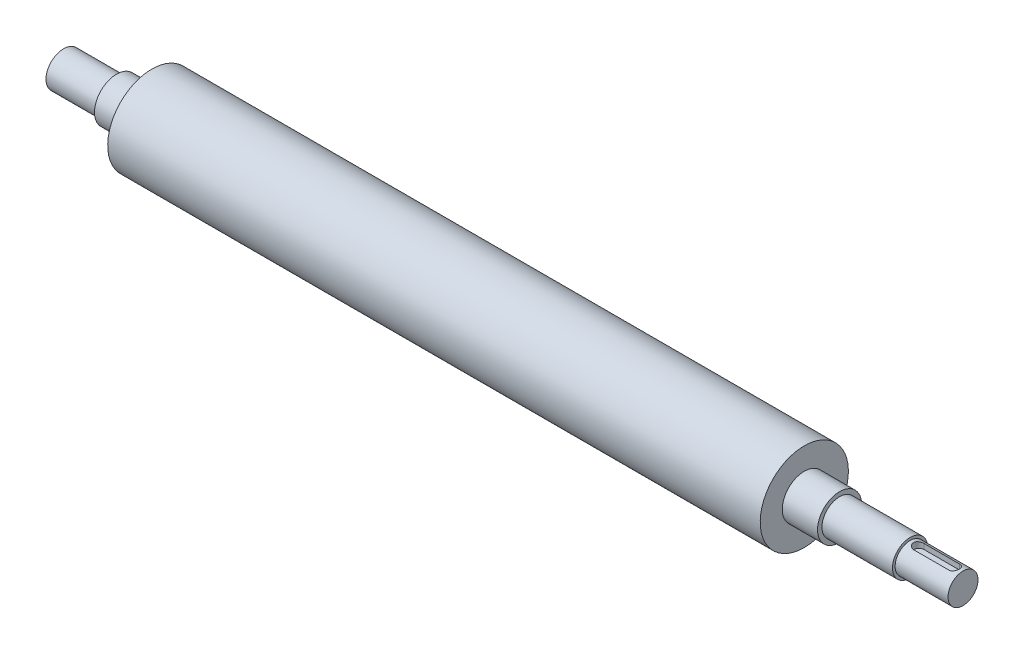
ISO-10303-21;
HEADER;
FILE_DESCRIPTION(('STEP AP214'),'2;1');
FILE_NAME('part.step','',(''),(''),'','','');
FILE_SCHEMA(('AUTOMOTIVE_DESIGN { 1 0 10303 214 1 1 1 1 }'));
ENDSEC;
DATA;
#1=APPLICATION_CONTEXT('core data for automotive mechanical design processes');
#2=APPLICATION_PROTOCOL_DEFINITION('international standard','automotive_design',2000,#1);
#3=PRODUCT_CONTEXT('',#1,'mechanical');
#4=PRODUCT('Part','Part','',(#3));
#5=PRODUCT_RELATED_PRODUCT_CATEGORY('part','',(#4));
#6=PRODUCT_DEFINITION_FORMATION('','',#4);
#7=PRODUCT_DEFINITION_CONTEXT('part definition',#1,'design');
#8=PRODUCT_DEFINITION('design','',#6,#7);
#9=PRODUCT_DEFINITION_SHAPE('','',#8);
#10=(LENGTH_UNIT() NAMED_UNIT(*) SI_UNIT(.MILLI.,.METRE.));
#11=(NAMED_UNIT(*) PLANE_ANGLE_UNIT() SI_UNIT($,.RADIAN.));
#12=(NAMED_UNIT(*) SI_UNIT($,.STERADIAN.) SOLID_ANGLE_UNIT());
#13=UNCERTAINTY_MEASURE_WITH_UNIT(LENGTH_MEASURE(1.E-05),#10,'distance_accuracy_value','');
#14=(GEOMETRIC_REPRESENTATION_CONTEXT(3) GLOBAL_UNCERTAINTY_ASSIGNED_CONTEXT((#13)) GLOBAL_UNIT_ASSIGNED_CONTEXT((#10,
#11,#12)) REPRESENTATION_CONTEXT('',''));
#15=CARTESIAN_POINT('',(0.,0.,0.));
#16=DIRECTION('',(0.,0.,1.));
#17=DIRECTION('',(1.,0.,0.));
#18=AXIS2_PLACEMENT_3D('',#15,#16,#17);
#19=CARTESIAN_POINT('',(245.,10.,0.));
#20=DIRECTION('',(-1.,0.,0.));
#21=DIRECTION('',(0.,-1.,0.));
#22=AXIS2_PLACEMENT_3D('',#19,#20,#21);
#23=PLANE('',#22);
#24=CARTESIAN_POINT('',(245.,0.,0.));
#25=DIRECTION('',(-1.,0.,0.));
#26=DIRECTION('',(0.,-1.,0.));
#27=AXIS2_PLACEMENT_3D('',#24,#25,#26);
#28=CIRCLE('',#27,9.99999999999999);
#29=CARTESIAN_POINT('',(245.,-9.99999999999993,0.));
#30=VERTEX_POINT('',#29);
#31=EDGE_CURVE('E160',#30,#30,#28,.T.);
#32=ORIENTED_EDGE('',*,*,#31,.F.);
#33=EDGE_LOOP('',(#32));
#34=FACE_BOUND('',#33,.T.);
#35=CARTESIAN_POINT('',(245.,0.,0.));
#36=DIRECTION('',(-1.,0.,0.));
#37=DIRECTION('',(0.,-1.,0.));
#38=AXIS2_PLACEMENT_3D('',#35,#36,#37);
#39=CIRCLE('',#38,8.49999999999994);
#40=CARTESIAN_POINT('',(245.,-8.49999999999988,0.));
#41=VERTEX_POINT('',#40);
#42=EDGE_CURVE('E111',#41,#41,#39,.T.);
#43=ORIENTED_EDGE('',*,*,#42,.T.);
#44=EDGE_LOOP('',(#43));
#45=FACE_BOUND('',#44,.T.);
#46=ADVANCED_FACE('F39',(#34,#45),#23,.F.);
#47=CARTESIAN_POINT('',(-235.,0.,0.));
#48=DIRECTION('',(-1.,0.,0.));
#49=DIRECTION('',(0.,-1.,0.));
#50=AXIS2_PLACEMENT_3D('',#47,#48,#49);
#51=CYLINDRICAL_SURFACE('',#50,9.99999999999999);
#52=CARTESIAN_POINT('',(205.,0.,0.));
#53=DIRECTION('',(-1.,0.,0.));
#54=DIRECTION('',(0.,-1.,0.));
#55=AXIS2_PLACEMENT_3D('',#52,#53,#54);
#56=CIRCLE('',#55,10.);
#57=CARTESIAN_POINT('',(205.,-9.99999999999994,0.));
#58=VERTEX_POINT('',#57);
#59=EDGE_CURVE('E156',#58,#58,#56,.T.);
#60=ORIENTED_EDGE('',*,*,#59,.F.);
#61=EDGE_LOOP('',(#60));
#62=FACE_BOUND('',#61,.T.);
#63=ORIENTED_EDGE('',*,*,#31,.T.);
#64=EDGE_LOOP('',(#63));
#65=FACE_BOUND('',#64,.T.);
#66=ADVANCED_FACE('F200',(#62,#65),#51,.T.);
#67=CARTESIAN_POINT('',(205.,10.,0.));
#68=DIRECTION('',(-1.,0.,0.));
#69=DIRECTION('',(0.,-1.,0.));
#70=AXIS2_PLACEMENT_3D('',#67,#68,#69);
#71=PLANE('',#70);
#72=CARTESIAN_POINT('',(205.,0.,0.));
#73=DIRECTION('',(-1.,0.,0.));
#74=DIRECTION('',(0.,-1.,0.));
#75=AXIS2_PLACEMENT_3D('',#72,#73,#74);
#76=CIRCLE('',#75,12.5);
#77=CARTESIAN_POINT('',(205.,-12.4999999999999,0.));
#78=VERTEX_POINT('',#77);
#79=EDGE_CURVE('E152',#78,#78,#76,.T.);
#80=ORIENTED_EDGE('',*,*,#79,.F.);
#81=EDGE_LOOP('',(#80));
#82=FACE_BOUND('',#81,.T.);
#83=ORIENTED_EDGE('',*,*,#59,.T.);
#84=EDGE_LOOP('',(#83));
#85=FACE_BOUND('',#84,.T.);
#86=ADVANCED_FACE('F205',(#82,#85),#71,.F.);
#87=CARTESIAN_POINT('',(-235.,0.,0.));
#88=DIRECTION('',(-1.,0.,0.));
#89=DIRECTION('',(0.,-1.,0.));
#90=AXIS2_PLACEMENT_3D('',#87,#88,#89);
#91=CYLINDRICAL_SURFACE('',#90,12.5);
#92=CARTESIAN_POINT('',(185.,0.,0.));
#93=DIRECTION('',(-1.,0.,0.));
#94=DIRECTION('',(0.,-1.,0.));
#95=AXIS2_PLACEMENT_3D('',#92,#93,#94);
#96=CIRCLE('',#95,12.5);
#97=CARTESIAN_POINT('',(185.,-12.4999999999999,0.));
#98=VERTEX_POINT('',#97);
#99=EDGE_CURVE('E148',#98,#98,#96,.T.);
#100=ORIENTED_EDGE('',*,*,#99,.F.);
#101=EDGE_LOOP('',(#100));
#102=FACE_BOUND('',#101,.T.);
#103=ORIENTED_EDGE('',*,*,#79,.T.);
#104=EDGE_LOOP('',(#103));
#105=FACE_BOUND('',#104,.T.);
#106=ADVANCED_FACE('F245',(#102,#105),#91,.T.);
#107=CARTESIAN_POINT('',(185.,25.,0.));
#108=DIRECTION('',(-1.,0.,0.));
#109=DIRECTION('',(0.,-1.,0.));
#110=AXIS2_PLACEMENT_3D('',#107,#108,#109);
#111=PLANE('',#110);
#112=CARTESIAN_POINT('',(185.,0.,0.));
#113=DIRECTION('',(-1.,0.,0.));
#114=DIRECTION('',(0.,-1.,0.));
#115=AXIS2_PLACEMENT_3D('',#112,#113,#114);
#116=CIRCLE('',#115,25.);
#117=CARTESIAN_POINT('',(185.,-24.9999999999999,0.));
#118=VERTEX_POINT('',#117);
#119=EDGE_CURVE('E144',#118,#118,#116,.T.);
#120=ORIENTED_EDGE('',*,*,#119,.F.);
#121=EDGE_LOOP('',(#120));
#122=FACE_BOUND('',#121,.T.);
#123=ORIENTED_EDGE('',*,*,#99,.T.);
#124=EDGE_LOOP('',(#123));
#125=FACE_BOUND('',#124,.T.);
#126=ADVANCED_FACE('F241',(#122,#125),#111,.F.);
#127=CARTESIAN_POINT('',(-235.,0.,0.));
#128=DIRECTION('',(-1.,0.,0.));
#129=DIRECTION('',(0.,-1.,0.));
#130=AXIS2_PLACEMENT_3D('',#127,#128,#129);
#131=CYLINDRICAL_SURFACE('',#130,25.);
#132=CARTESIAN_POINT('',(-185.,0.,0.));
#133=DIRECTION('',(-1.,0.,0.));
#134=DIRECTION('',(0.,-1.,0.));
#135=AXIS2_PLACEMENT_3D('',#132,#133,#134);
#136=CIRCLE('',#135,25.);
#137=CARTESIAN_POINT('',(-185.,-25.,0.));
#138=VERTEX_POINT('',#137);
#139=EDGE_CURVE('E140',#138,#138,#136,.T.);
#140=ORIENTED_EDGE('',*,*,#139,.F.);
#141=EDGE_LOOP('',(#140));
#142=FACE_BOUND('',#141,.T.);
#143=ORIENTED_EDGE('',*,*,#119,.T.);
#144=EDGE_LOOP('',(#143));
#145=FACE_BOUND('',#144,.T.);
#146=ADVANCED_FACE('F237',(#142,#145),#131,.T.);
#147=CARTESIAN_POINT('',(-185.,25.,0.));
#148=DIRECTION('',(1.,0.,0.));
#149=DIRECTION('',(0.,1.,0.));
#150=AXIS2_PLACEMENT_3D('',#147,#148,#149);
#151=PLANE('',#150);
#152=CARTESIAN_POINT('',(-185.,0.,0.));
#153=DIRECTION('',(-1.,0.,0.));
#154=DIRECTION('',(0.,-1.,0.));
#155=AXIS2_PLACEMENT_3D('',#152,#153,#154);
#156=CIRCLE('',#155,12.5);
#157=CARTESIAN_POINT('',(-185.,-12.5,0.));
#158=VERTEX_POINT('',#157);
#159=EDGE_CURVE('E136',#158,#158,#156,.T.);
#160=ORIENTED_EDGE('',*,*,#159,.F.);
#161=EDGE_LOOP('',(#160));
#162=FACE_BOUND('',#161,.T.);
#163=ORIENTED_EDGE('',*,*,#139,.T.);
#164=EDGE_LOOP('',(#163));
#165=FACE_BOUND('',#164,.T.);
#166=ADVANCED_FACE('F233',(#162,#165),#151,.F.);
#167=CARTESIAN_POINT('',(-235.,0.,0.));
#168=DIRECTION('',(-1.,0.,0.));
#169=DIRECTION('',(0.,-1.,0.));
#170=AXIS2_PLACEMENT_3D('',#167,#168,#169);
#171=CYLINDRICAL_SURFACE('',#170,12.5);
#172=CARTESIAN_POINT('',(-205.,0.,0.));
#173=DIRECTION('',(-1.,0.,0.));
#174=DIRECTION('',(0.,-1.,0.));
#175=AXIS2_PLACEMENT_3D('',#172,#173,#174);
#176=CIRCLE('',#175,12.5);
#177=CARTESIAN_POINT('',(-205.,-12.5,0.));
#178=VERTEX_POINT('',#177);
#179=EDGE_CURVE('E132',#178,#178,#176,.T.);
#180=ORIENTED_EDGE('',*,*,#179,.F.);
#181=EDGE_LOOP('',(#180));
#182=FACE_BOUND('',#181,.T.);
#183=ORIENTED_EDGE('',*,*,#159,.T.);
#184=EDGE_LOOP('',(#183));
#185=FACE_BOUND('',#184,.T.);
#186=ADVANCED_FACE('F229',(#182,#185),#171,.T.);
#187=CARTESIAN_POINT('',(-205.,10.,0.));
#188=DIRECTION('',(1.,0.,0.));
#189=DIRECTION('',(0.,1.,0.));
#190=AXIS2_PLACEMENT_3D('',#187,#188,#189);
#191=PLANE('',#190);
#192=CARTESIAN_POINT('',(-205.,0.,0.));
#193=DIRECTION('',(-1.,0.,0.));
#194=DIRECTION('',(0.,-1.,0.));
#195=AXIS2_PLACEMENT_3D('',#192,#193,#194);
#196=CIRCLE('',#195,10.);
#197=CARTESIAN_POINT('',(-205.,-9.99999999999999,0.));
#198=VERTEX_POINT('',#197);
#199=EDGE_CURVE('E128',#198,#198,#196,.T.);
#200=ORIENTED_EDGE('',*,*,#199,.F.);
#201=EDGE_LOOP('',(#200));
#202=FACE_BOUND('',#201,.T.);
#203=ORIENTED_EDGE('',*,*,#179,.T.);
#204=EDGE_LOOP('',(#203));
#205=FACE_BOUND('',#204,.T.);
#206=ADVANCED_FACE('F225',(#202,#205),#191,.F.);
#207=CARTESIAN_POINT('',(-235.,0.,0.));
#208=DIRECTION('',(-1.,0.,0.));
#209=DIRECTION('',(0.,-1.,0.));
#210=AXIS2_PLACEMENT_3D('',#207,#208,#209);
#211=CYLINDRICAL_SURFACE('',#210,10.);
#212=CARTESIAN_POINT('',(-235.,0.,0.));
#213=DIRECTION('',(-1.,0.,0.));
#214=DIRECTION('',(0.,-1.,0.));
#215=AXIS2_PLACEMENT_3D('',#212,#213,#214);
#216=CIRCLE('',#215,10.);
#217=CARTESIAN_POINT('',(-235.,-10.,0.));
#218=VERTEX_POINT('',#217);
#219=EDGE_CURVE('E124',#218,#218,#216,.T.);
#220=ORIENTED_EDGE('',*,*,#219,.F.);
#221=EDGE_LOOP('',(#220));
#222=FACE_BOUND('',#221,.T.);
#223=ORIENTED_EDGE('',*,*,#199,.T.);
#224=EDGE_LOOP('',(#223));
#225=FACE_BOUND('',#224,.T.);
#226=ADVANCED_FACE('F219',(#222,#225),#211,.T.);
#227=CARTESIAN_POINT('',(-235.,10.,0.));
#228=DIRECTION('',(1.,0.,0.));
#229=DIRECTION('',(0.,1.,0.));
#230=AXIS2_PLACEMENT_3D('',#227,#228,#229);
#231=PLANE('',#230);
#232=ORIENTED_EDGE('',*,*,#219,.T.);
#233=EDGE_LOOP('',(#232));
#234=FACE_BOUND('',#233,.T.);
#235=ADVANCED_FACE('F215',(#234),#231,.F.);
#236=CARTESIAN_POINT('',(275.,8.5,0.));
#237=DIRECTION('',(-1.,0.,0.));
#238=DIRECTION('',(0.,-1.,0.));
#239=AXIS2_PLACEMENT_3D('',#236,#237,#238);
#240=PLANE('',#239);
#241=CARTESIAN_POINT('',(275.,0.,0.));
#242=DIRECTION('',(-1.,0.,0.));
#243=DIRECTION('',(0.,-1.,0.));
#244=AXIS2_PLACEMENT_3D('',#241,#242,#243);
#245=CIRCLE('',#244,8.49999999999994);
#246=CARTESIAN_POINT('',(275.,-8.49999999999988,0.));
#247=VERTEX_POINT('',#246);
#248=EDGE_CURVE('E120',#247,#247,#245,.T.);
#249=ORIENTED_EDGE('',*,*,#248,.F.);
#250=EDGE_LOOP('',(#249));
#251=FACE_BOUND('',#250,.T.);
#252=ADVANCED_FACE('F197',(#251),#240,.F.);
#253=CARTESIAN_POINT('',(-235.,0.,0.));
#254=DIRECTION('',(-1.,0.,0.));
#255=DIRECTION('',(0.,-1.,0.));
#256=AXIS2_PLACEMENT_3D('',#253,#254,#255);
#257=CYLINDRICAL_SURFACE('',#256,8.49999999999994);
#258=DIRECTION('',(-1.,0.,0.));
#259=VECTOR('',#258,1.);
#260=CARTESIAN_POINT('',(-235.,7.95298686029337,-3.));
#261=LINE('',#260,#259);
#262=CARTESIAN_POINT('',(250.,7.95298686029343,-3.));
#263=VERTEX_POINT('',#262);
#264=CARTESIAN_POINT('',(270.,7.95298686029343,-3.));
#265=VERTEX_POINT('',#264);
#266=EDGE_CURVE('E11',#263,#265,#261,.F.);
#267=ORIENTED_EDGE('',*,*,#266,.T.);
#268=CARTESIAN_POINT('',(270.,7.95298686029343,-3.));
#269=CARTESIAN_POINT('',(270.081536451005,7.95297282317496,-3.00001111456469));
#270=CARTESIAN_POINT('',(270.16306513686,7.95424043309808,-2.99667616281438));
#271=CARTESIAN_POINT('',(270.32548339821,7.95923435007447,-2.98340078818416));
#272=CARTESIAN_POINT('',(270.406373157799,7.96295992065867,-2.97346234387641));
#273=CARTESIAN_POINT('',(270.56668088422,7.97274948260351,-2.94710907165024));
#274=CARTESIAN_POINT('',(270.646102753267,7.97880590130024,-2.93071521269501));
#275=CARTESIAN_POINT('',(270.803163764054,7.99305602658037,-2.89162336922697));
#276=CARTESIAN_POINT('',(270.88080282945,8.00124982450609,-2.86892511528895));
#277=CARTESIAN_POINT('',(271.110142384458,8.02866628944345,-2.79169040620691));
#278=CARTESIAN_POINT('',(271.258524672721,8.05074111407848,-2.72797079291555));
#279=CARTESIAN_POINT('',(271.542527359639,8.09998309095397,-2.57807364735464));
#280=CARTESIAN_POINT('',(271.678138633491,8.12715384335239,-2.49188022094082));
#281=CARTESIAN_POINT('',(271.938713920334,8.18485393887847,-2.29543806114915));
#282=CARTESIAN_POINT('',(272.063041901653,8.21547377204857,-2.1843705023649));
#283=CARTESIAN_POINT('',(272.291744233027,8.27586220443751,-1.94307879798324));
#284=CARTESIAN_POINT('',(272.396114896453,8.30563064552034,-1.81285112086691));
#285=CARTESIAN_POINT('',(272.584937067793,8.36202878085584,-1.53216678509012));
#286=CARTESIAN_POINT('',(272.668705670584,8.38853913830339,-1.38122456099169));
#287=CARTESIAN_POINT('',(272.809399535875,8.43435112113579,-1.06629732099155));
#288=CARTESIAN_POINT('',(272.866333820396,8.45365516891426,-0.902316710454007));
#289=CARTESIAN_POINT('',(272.949541995578,8.48223599195917,-0.572686128989449));
#290=CARTESIAN_POINT('',(272.976915424825,8.49187134280002,-0.407345398684575));
#291=CARTESIAN_POINT('',(273.003733376199,8.50130846817215,-0.0741521905856608));
#292=CARTESIAN_POINT('',(273.003185431652,8.50111289513587,0.093699597494171));
#293=CARTESIAN_POINT('',(272.974846478054,8.49114603495175,0.41931771456752));
#294=CARTESIAN_POINT('',(272.948252655351,8.4817955547378,0.577203282323874));
#295=CARTESIAN_POINT('',(272.870572820571,8.4551088236348,0.8861046421019));
#296=CARTESIAN_POINT('',(272.819485427458,8.43777212245602,1.03712004623328));
#297=CARTESIAN_POINT('',(272.693635628535,8.39655303420164,1.33047393825551));
#298=CARTESIAN_POINT('',(272.618554253207,8.3725830778079,1.47266277963517));
#299=CARTESIAN_POINT('',(272.447121442264,8.32056133127557,1.74275783980201));
#300=CARTESIAN_POINT('',(272.350763660659,8.29250832416193,1.87065978014285));
#301=CARTESIAN_POINT('',(272.133598733569,8.2335160105887,2.11563702552314));
#302=CARTESIAN_POINT('',(272.011776607443,8.2025024832695,2.23179650903278));
#303=CARTESIAN_POINT('',(271.750160727051,8.14228789618759,2.44236946081564));
#304=CARTESIAN_POINT('',(271.610360688581,8.11308747551658,2.53677529269979));
#305=CARTESIAN_POINT('',(271.313330116575,8.05935715695286,2.70269404193957));
#306=CARTESIAN_POINT('',(271.155828875121,8.03492183287739,2.77375950589015));
#307=CARTESIAN_POINT('',(270.911749632011,8.00466863989459,2.85940108363551));
#308=CARTESIAN_POINT('',(270.829101690326,7.99565197491509,2.88445274898887));
#309=CARTESIAN_POINT('',(270.661749484643,7.98003696838128,2.92737680685404));
#310=CARTESIAN_POINT('',(270.577046172907,7.97343752889355,2.94525245915398));
#311=CARTESIAN_POINT('',(270.410501437027,7.96316283519177,2.97292025835955));
#312=CARTESIAN_POINT('',(270.328726985238,7.95935855696889,2.9830699821345));
#313=CARTESIAN_POINT('',(270.164637991123,7.95426482451694,2.99661152862991));
#314=CARTESIAN_POINT('',(270.082324173949,7.95297249738802,3.00001107157817));
#315=CARTESIAN_POINT('',(270.,7.95298686029343,3.));
#316=B_SPLINE_CURVE_WITH_KNOTS('',3,(#268,#269,#270,#271,#272,#273,#274,#275,#276,#277,#278,
#279,#280,#281,#282,#283,#284,#285,#286,#287,#288,#289,#290,#291,#292,#293,#294,#295,#296,#297,
#298,#299,#300,#301,#302,#303,#304,#305,#306,#307,#308,#309,#310,#311,#312,#313,#314,#315),
.UNSPECIFIED.,.F.,.F.,(4,2,2,2,2,2,2,2,2,2,2,2,2,2,2,2,2,2,2,2,2,2,2,4),(0.,0.244518263038698,
0.48896329528471,0.73262076744457,0.976288654175243,1.46284365984006,1.94974370936357,
2.45596459157656,2.96227889562561,3.48361603671224,4.00477777271076,4.50580525888537,
5.00669756606285,5.48559776782672,5.96452497488343,6.45010405019667,6.93582815245477,
7.44695039963332,7.95825179844938,8.47884978164188,8.7390503763821,8.99913263783281,
9.24628958943068,9.4931637027445),.UNSPECIFIED.);
#317=CARTESIAN_POINT('',(270.,7.95298686029343,3.));
#318=VERTEX_POINT('',#317);
#319=EDGE_CURVE('E164',#265,#318,#316,.T.);
#320=ORIENTED_EDGE('',*,*,#319,.T.);
#321=DIRECTION('',(-1.,0.,0.));
#322=VECTOR('',#321,1.);
#323=CARTESIAN_POINT('',(-235.,7.95298686029337,3.));
#324=LINE('',#323,#322);
#325=CARTESIAN_POINT('',(250.,7.95298686029343,3.));
#326=VERTEX_POINT('',#325);
#327=EDGE_CURVE('E47',#318,#326,#324,.T.);
#328=ORIENTED_EDGE('',*,*,#327,.T.);
#329=CARTESIAN_POINT('',(250.,7.95298686029343,3.));
#330=CARTESIAN_POINT('',(249.918463548995,7.95297282317496,3.0000111145647));
#331=CARTESIAN_POINT('',(249.83693486314,7.95424043309807,2.99667616281439));
#332=CARTESIAN_POINT('',(249.67451660179,7.95923435007447,2.98340078818416));
#333=CARTESIAN_POINT('',(249.593626842201,7.96295992065867,2.97346234387641));
#334=CARTESIAN_POINT('',(249.43331911578,7.9727494826035,2.94710907165024));
#335=CARTESIAN_POINT('',(249.353897246733,7.97880590130023,2.93071521269502));
#336=CARTESIAN_POINT('',(249.196836235946,7.99305602658036,2.89162336922697));
#337=CARTESIAN_POINT('',(249.11919717055,8.00124982450609,2.86892511528896));
#338=CARTESIAN_POINT('',(248.889857615542,8.02866628944344,2.79169040620692));
#339=CARTESIAN_POINT('',(248.741475327279,8.05074111407847,2.72797079291555));
#340=CARTESIAN_POINT('',(248.457472640361,8.09998309095396,2.57807364735465));
#341=CARTESIAN_POINT('',(248.321861366509,8.12715384335238,2.49188022094085));
#342=CARTESIAN_POINT('',(248.061286079666,8.18485393887845,2.29543806114918));
#343=CARTESIAN_POINT('',(247.936958098347,8.21547377204856,2.18437050236493));
#344=CARTESIAN_POINT('',(247.708255766973,8.2758622044375,1.94307879798327));
#345=CARTESIAN_POINT('',(247.603885103547,8.30563064552033,1.81285112086695));
#346=CARTESIAN_POINT('',(247.415062932207,8.36202878085582,1.53216678509016));
#347=CARTESIAN_POINT('',(247.331294329416,8.38853913830338,1.38122456099173));
#348=CARTESIAN_POINT('',(247.190600464125,8.43435112113579,1.06629732099156));
#349=CARTESIAN_POINT('',(247.133666179604,8.45365516891425,0.902316710454014));
#350=CARTESIAN_POINT('',(247.050458004422,8.48223599195916,0.572686128989452));
#351=CARTESIAN_POINT('',(247.023084575175,8.49187134280002,0.407345398684583));
#352=CARTESIAN_POINT('',(246.996266623801,8.50130846817214,0.0741521905856763));
#353=CARTESIAN_POINT('',(246.996814568348,8.50111289513587,-0.0936995974941523));
#354=CARTESIAN_POINT('',(247.025153521946,8.49114603495175,-0.419317714567499));
#355=CARTESIAN_POINT('',(247.051747344649,8.4817955547378,-0.577203282323854));
#356=CARTESIAN_POINT('',(247.129427179429,8.45510882363479,-0.886104642101878));
#357=CARTESIAN_POINT('',(247.180514572542,8.43777212245601,-1.03712004623325));
#358=CARTESIAN_POINT('',(247.306364371465,8.39655303420163,-1.33047393825549));
#359=CARTESIAN_POINT('',(247.381445746793,8.3725830778079,-1.47266277963516));
#360=CARTESIAN_POINT('',(247.552878557736,8.32056133127557,-1.74275783980199));
#361=CARTESIAN_POINT('',(247.649236339341,8.29250832416194,-1.87065978014283));
#362=CARTESIAN_POINT('',(247.866401266431,8.23351601058871,-2.1156370255231));
#363=CARTESIAN_POINT('',(247.988223392557,8.20250248326951,-2.23179650903275));
#364=CARTESIAN_POINT('',(248.249839272948,8.14228789618759,-2.44236946081561));
#365=CARTESIAN_POINT('',(248.389639311419,8.11308747551659,-2.53677529269977));
#366=CARTESIAN_POINT('',(248.686669883425,8.05935715695286,-2.70269404193956));
#367=CARTESIAN_POINT('',(248.844171124879,8.03492183287739,-2.77375950589015));
#368=CARTESIAN_POINT('',(249.088250367989,8.00466863989459,-2.85940108363552));
#369=CARTESIAN_POINT('',(249.170898309674,7.99565197491509,-2.88445274898888));
#370=CARTESIAN_POINT('',(249.338250515357,7.98003696838128,-2.92737680685404));
#371=CARTESIAN_POINT('',(249.422953827093,7.97343752889355,-2.94525245915397));
#372=CARTESIAN_POINT('',(249.589498562973,7.96316283519176,-2.97292025835955));
#373=CARTESIAN_POINT('',(249.671273014762,7.95935855696889,-2.9830699821345));
#374=CARTESIAN_POINT('',(249.835362008877,7.95426482451694,-2.99661152862991));
#375=CARTESIAN_POINT('',(249.917675826051,7.95297249738802,-3.00001107157817));
#376=CARTESIAN_POINT('',(250.,7.95298686029343,-3.));
#377=B_SPLINE_CURVE_WITH_KNOTS('',3,(#329,#330,#331,#332,#333,#334,#335,#336,#337,#338,#339,
#340,#341,#342,#343,#344,#345,#346,#347,#348,#349,#350,#351,#352,#353,#354,#355,#356,#357,#358,
#359,#360,#361,#362,#363,#364,#365,#366,#367,#368,#369,#370,#371,#372,#373,#374,#375,#376),
.UNSPECIFIED.,.F.,.F.,(4,2,2,2,2,2,2,2,2,2,2,2,2,2,2,2,2,2,2,2,2,2,2,4),(0.,0.244518263038642,
0.488963295284682,0.732620767444569,0.976288654175213,1.46284365984006,1.9497437093635,
2.45596459157652,2.96227889562557,3.4836160367122,4.00477777271075,4.50580525888535,
5.00669756606282,5.4855977678267,5.9645249748834,6.45010405019663,6.93582815245475,
7.44695039963322,7.95825179844932,8.47884978164192,8.73905037638212,8.99913263783274,
9.24628958943067,9.49316370274449),.UNSPECIFIED.);
#378=EDGE_CURVE('E54',#326,#263,#377,.T.);
#379=ORIENTED_EDGE('',*,*,#378,.T.);
#380=EDGE_LOOP('',(#267,#320,#328,#379));
#381=FACE_BOUND('',#380,.T.);
#382=ORIENTED_EDGE('',*,*,#42,.F.);
#383=EDGE_LOOP('',(#382));
#384=FACE_BOUND('',#383,.T.);
#385=ORIENTED_EDGE('',*,*,#248,.T.);
#386=EDGE_LOOP('',(#385));
#387=FACE_BOUND('',#386,.T.);
#388=ADVANCED_FACE('F179',(#381,#384,#387),#257,.T.);
#389=CARTESIAN_POINT('',(250.,5.,0.));
#390=DIRECTION('',(0.,1.,0.));
#391=DIRECTION('',(-1.,0.,0.));
#392=AXIS2_PLACEMENT_3D('',#389,#390,#391);
#393=CYLINDRICAL_SURFACE('',#392,3.);
#394=DIRECTION('',(0.,1.,0.));
#395=VECTOR('',#394,1.);
#396=CARTESIAN_POINT('',(250.,5.,3.));
#397=LINE('',#396,#395);
#398=CARTESIAN_POINT('',(250.,5.,3.));
#399=VERTEX_POINT('',#398);
#400=EDGE_CURVE('E77',#399,#326,#397,.T.);
#401=ORIENTED_EDGE('',*,*,#400,.F.);
#402=CARTESIAN_POINT('',(250.,5.,0.));
#403=DIRECTION('',(0.,1.,0.));
#404=DIRECTION('',(-1.,0.,0.));
#405=AXIS2_PLACEMENT_3D('',#402,#403,#404);
#406=CIRCLE('',#405,3.);
#407=CARTESIAN_POINT('',(250.,5.,-3.));
#408=VERTEX_POINT('',#407);
#409=EDGE_CURVE('E81',#408,#399,#406,.T.);
#410=ORIENTED_EDGE('',*,*,#409,.F.);
#411=DIRECTION('',(0.,1.,0.));
#412=VECTOR('',#411,1.);
#413=CARTESIAN_POINT('',(250.,5.,-3.));
#414=LINE('',#413,#412);
#415=EDGE_CURVE('E108',#408,#263,#414,.T.);
#416=ORIENTED_EDGE('',*,*,#415,.T.);
#417=ORIENTED_EDGE('',*,*,#378,.F.);
#418=EDGE_LOOP('',(#401,#410,#416,#417));
#419=FACE_BOUND('',#418,.T.);
#420=ADVANCED_FACE('F79',(#419),#393,.F.);
#421=CARTESIAN_POINT('',(250.,5.,-3.));
#422=DIRECTION('',(0.,0.,-1.));
#423=DIRECTION('',(-1.,0.,0.));
#424=AXIS2_PLACEMENT_3D('',#421,#422,#423);
#425=PLANE('',#424);
#426=ORIENTED_EDGE('',*,*,#415,.F.);
#427=DIRECTION('',(-1.,0.,0.));
#428=VECTOR('',#427,1.);
#429=CARTESIAN_POINT('',(250.,5.,-3.));
#430=LINE('',#429,#428);
#431=CARTESIAN_POINT('',(270.,5.,-3.));
#432=VERTEX_POINT('',#431);
#433=EDGE_CURVE('E87',#432,#408,#430,.T.);
#434=ORIENTED_EDGE('',*,*,#433,.F.);
#435=DIRECTION('',(0.,1.,0.));
#436=VECTOR('',#435,1.);
#437=CARTESIAN_POINT('',(270.,5.,-3.));
#438=LINE('',#437,#436);
#439=EDGE_CURVE('E112',#432,#265,#438,.T.);
#440=ORIENTED_EDGE('',*,*,#439,.T.);
#441=ORIENTED_EDGE('',*,*,#266,.F.);
#442=EDGE_LOOP('',(#426,#434,#440,#441));
#443=FACE_BOUND('',#442,.T.);
#444=ADVANCED_FACE('F187',(#443),#425,.F.);
#445=CARTESIAN_POINT('',(270.,5.,0.));
#446=DIRECTION('',(0.,1.,0.));
#447=DIRECTION('',(-1.,0.,0.));
#448=AXIS2_PLACEMENT_3D('',#445,#446,#447);
#449=CYLINDRICAL_SURFACE('',#448,3.);
#450=ORIENTED_EDGE('',*,*,#439,.F.);
#451=CARTESIAN_POINT('',(270.,5.,0.));
#452=DIRECTION('',(0.,1.,0.));
#453=DIRECTION('',(-1.,0.,0.));
#454=AXIS2_PLACEMENT_3D('',#451,#452,#453);
#455=CIRCLE('',#454,3.);
#456=CARTESIAN_POINT('',(270.,5.,3.));
#457=VERTEX_POINT('',#456);
#458=EDGE_CURVE('E97',#457,#432,#455,.T.);
#459=ORIENTED_EDGE('',*,*,#458,.F.);
#460=DIRECTION('',(0.,1.,0.));
#461=VECTOR('',#460,1.);
#462=CARTESIAN_POINT('',(270.,5.,3.));
#463=LINE('',#462,#461);
#464=EDGE_CURVE('E86',#457,#318,#463,.T.);
#465=ORIENTED_EDGE('',*,*,#464,.T.);
#466=ORIENTED_EDGE('',*,*,#319,.F.);
#467=EDGE_LOOP('',(#450,#459,#465,#466));
#468=FACE_BOUND('',#467,.T.);
#469=ADVANCED_FACE('F182',(#468),#449,.F.);
#470=CARTESIAN_POINT('',(250.,5.,3.));
#471=DIRECTION('',(0.,0.,1.));
#472=DIRECTION('',(1.,0.,0.));
#473=AXIS2_PLACEMENT_3D('',#470,#471,#472);
#474=PLANE('',#473);
#475=ORIENTED_EDGE('',*,*,#464,.F.);
#476=DIRECTION('',(1.,0.,0.));
#477=VECTOR('',#476,1.);
#478=CARTESIAN_POINT('',(250.,5.,3.));
#479=LINE('',#478,#477);
#480=EDGE_CURVE('E90',#399,#457,#479,.T.);
#481=ORIENTED_EDGE('',*,*,#480,.F.);
#482=ORIENTED_EDGE('',*,*,#400,.T.);
#483=ORIENTED_EDGE('',*,*,#327,.F.);
#484=EDGE_LOOP('',(#475,#481,#482,#483));
#485=FACE_BOUND('',#484,.T.);
#486=ADVANCED_FACE('F91',(#485),#474,.F.);
#487=CARTESIAN_POINT('',(250.,5.,0.));
#488=DIRECTION('',(0.,1.,0.));
#489=DIRECTION('',(-1.,0.,0.));
#490=AXIS2_PLACEMENT_3D('',#487,#488,#489);
#491=PLANE('',#490);
#492=ORIENTED_EDGE('',*,*,#409,.T.);
#493=ORIENTED_EDGE('',*,*,#480,.T.);
#494=ORIENTED_EDGE('',*,*,#458,.T.);
#495=ORIENTED_EDGE('',*,*,#433,.T.);
#496=EDGE_LOOP('',(#492,#493,#494,#495));
#497=FACE_BOUND('',#496,.T.);
#498=ADVANCED_FACE('F99',(#497),#491,.T.);
#499=CLOSED_SHELL('',(#46,#66,#86,#106,#126,#146,#166,#186,#206,#226,#235,#252,#388,#420,#444,
#469,#486,#498));
#500=MANIFOLD_SOLID_BREP('B2',#499);
#501=ADVANCED_BREP_SHAPE_REPRESENTATION('',(#18,#500),#14);
#502=SHAPE_DEFINITION_REPRESENTATION(#9,#501);
ENDSEC;
END-ISO-10303-21;
